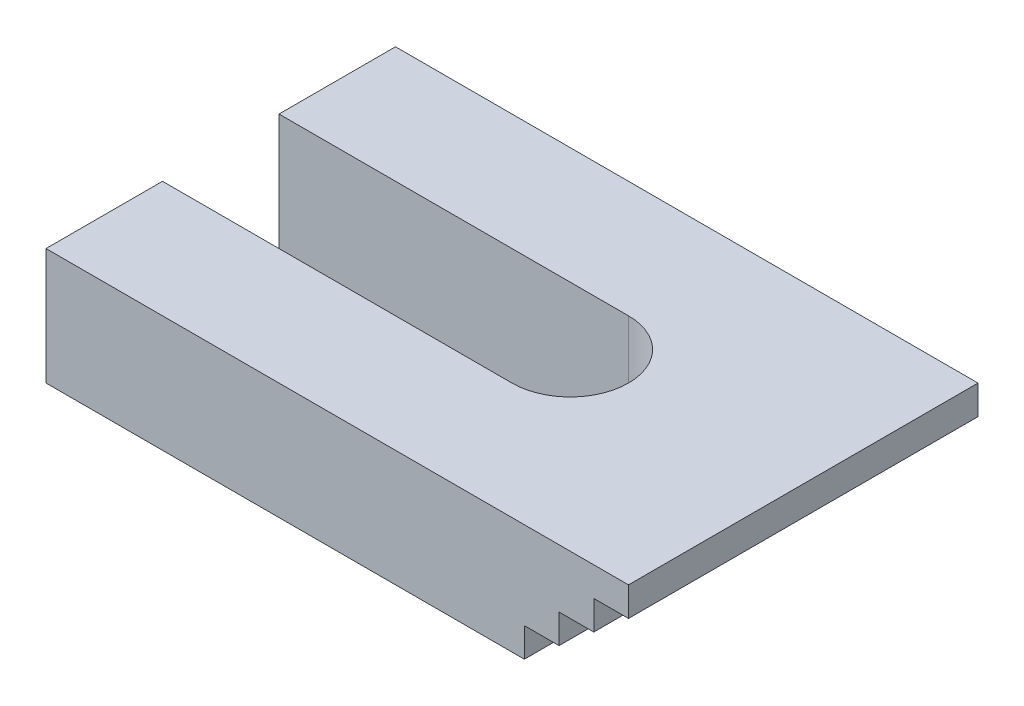
ISO-10303-21;
HEADER;
FILE_DESCRIPTION(('STEP AP214'),'2;1');
FILE_NAME('part.step','',(''),(''),'','','');
FILE_SCHEMA(('AUTOMOTIVE_DESIGN { 1 0 10303 214 1 1 1 1 }'));
ENDSEC;
DATA;
#1=APPLICATION_CONTEXT('core data for automotive mechanical design processes');
#2=APPLICATION_PROTOCOL_DEFINITION('international standard','automotive_design',2000,#1);
#3=PRODUCT_CONTEXT('',#1,'mechanical');
#4=PRODUCT('Part','Part','',(#3));
#5=PRODUCT_RELATED_PRODUCT_CATEGORY('part','',(#4));
#6=PRODUCT_DEFINITION_FORMATION('','',#4);
#7=PRODUCT_DEFINITION_CONTEXT('part definition',#1,'design');
#8=PRODUCT_DEFINITION('design','',#6,#7);
#9=PRODUCT_DEFINITION_SHAPE('','',#8);
#10=(LENGTH_UNIT() NAMED_UNIT(*) SI_UNIT(.MILLI.,.METRE.));
#11=(NAMED_UNIT(*) PLANE_ANGLE_UNIT() SI_UNIT($,.RADIAN.));
#12=(NAMED_UNIT(*) SI_UNIT($,.STERADIAN.) SOLID_ANGLE_UNIT());
#13=UNCERTAINTY_MEASURE_WITH_UNIT(LENGTH_MEASURE(1.E-05),#10,'distance_accuracy_value','');
#14=(GEOMETRIC_REPRESENTATION_CONTEXT(3) GLOBAL_UNCERTAINTY_ASSIGNED_CONTEXT((#13)) GLOBAL_UNIT_ASSIGNED_CONTEXT((#10,
#11,#12)) REPRESENTATION_CONTEXT('',''));
#15=CARTESIAN_POINT('',(0.,0.,0.));
#16=DIRECTION('',(0.,0.,1.));
#17=DIRECTION('',(1.,0.,0.));
#18=AXIS2_PLACEMENT_3D('',#15,#16,#17);
#19=CARTESIAN_POINT('',(-49.5371666557467,5.22830018411507,30.));
#20=DIRECTION('',(1.,0.,0.));
#21=DIRECTION('',(0.,0.,-1.));
#22=AXIS2_PLACEMENT_3D('',#19,#20,#21);
#23=PLANE('',#22);
#24=DIRECTION('',(0.,0.,-1.));
#25=VECTOR('',#24,1.);
#26=CARTESIAN_POINT('',(-49.5371666557467,5.22830018411507,30.));
#27=LINE('',#26,#25);
#28=CARTESIAN_POINT('',(-49.5371666557467,5.22830018411507,30.));
#29=VERTEX_POINT('',#28);
#30=CARTESIAN_POINT('',(-49.5371666557467,5.22830018411507,20.));
#31=VERTEX_POINT('',#30);
#32=EDGE_CURVE('E157',#29,#31,#27,.T.);
#33=ORIENTED_EDGE('',*,*,#32,.T.);
#34=DIRECTION('',(0.,1.,0.));
#35=VECTOR('',#34,1.);
#36=CARTESIAN_POINT('',(-49.5371666557467,-4.77169981588493,20.));
#37=LINE('',#36,#35);
#38=CARTESIAN_POINT('',(-49.5371666557467,-4.77169981588493,20.));
#39=VERTEX_POINT('',#38);
#40=EDGE_CURVE('E296',#39,#31,#37,.T.);
#41=ORIENTED_EDGE('',*,*,#40,.F.);
#42=DIRECTION('',(0.,0.,-1.));
#43=VECTOR('',#42,1.);
#44=CARTESIAN_POINT('',(-49.5371666557467,-4.77169981588494,30.));
#45=LINE('',#44,#43);
#46=CARTESIAN_POINT('',(-49.5371666557467,-4.77169981588494,30.));
#47=VERTEX_POINT('',#46);
#48=EDGE_CURVE('E199',#47,#39,#45,.T.);
#49=ORIENTED_EDGE('',*,*,#48,.F.);
#50=DIRECTION('',(0.,-1.,0.));
#51=VECTOR('',#50,1.);
#52=CARTESIAN_POINT('',(-49.5371666557467,5.22830018411507,30.));
#53=LINE('',#52,#51);
#54=EDGE_CURVE('E64',#29,#47,#53,.T.);
#55=ORIENTED_EDGE('',*,*,#54,.F.);
#56=EDGE_LOOP('',(#33,#41,#49,#55));
#57=FACE_BOUND('',#56,.T.);
#58=ADVANCED_FACE('F39',(#57),#23,.F.);
#59=CARTESIAN_POINT('',(-8.47593461871784,-4.77169981588493,30.));
#60=DIRECTION('',(0.,1.,0.));
#61=DIRECTION('',(-1.,0.,0.));
#62=AXIS2_PLACEMENT_3D('',#59,#60,#61);
#63=PLANE('',#62);
#64=ORIENTED_EDGE('',*,*,#48,.T.);
#65=DIRECTION('',(1.,0.,0.));
#66=VECTOR('',#65,1.);
#67=CARTESIAN_POINT('',(-19.5371666557467,-4.77169981588493,20.));
#68=LINE('',#67,#66);
#69=CARTESIAN_POINT('',(-19.5371666557467,-4.77169981588493,20.));
#70=VERTEX_POINT('',#69);
#71=EDGE_CURVE('E292',#39,#70,#68,.T.);
#72=ORIENTED_EDGE('',*,*,#71,.T.);
#73=CARTESIAN_POINT('',(-19.5371666557467,-4.77169981588493,15.));
#74=DIRECTION('',(0.,1.,0.));
#75=DIRECTION('',(0.,0.,-1.));
#76=AXIS2_PLACEMENT_3D('',#73,#74,#75);
#77=CIRCLE('',#76,5.);
#78=CARTESIAN_POINT('',(-19.5371666557467,-4.77169981588493,10.));
#79=VERTEX_POINT('',#78);
#80=EDGE_CURVE('E286',#70,#79,#77,.T.);
#81=ORIENTED_EDGE('',*,*,#80,.T.);
#82=DIRECTION('',(-1.,0.,0.));
#83=VECTOR('',#82,1.);
#84=CARTESIAN_POINT('',(-19.5371666557467,-4.77169981588493,10.));
#85=LINE('',#84,#83);
#86=CARTESIAN_POINT('',(-49.5371666557467,-4.77169981588493,10.));
#87=VERTEX_POINT('',#86);
#88=EDGE_CURVE('E281',#79,#87,#85,.T.);
#89=ORIENTED_EDGE('',*,*,#88,.T.);
#90=CARTESIAN_POINT('',(-49.5371666557467,-4.77169981588494,0.));
#91=VERTEX_POINT('',#90);
#92=EDGE_CURVE('E104',#87,#91,#45,.T.);
#93=ORIENTED_EDGE('',*,*,#92,.T.);
#94=DIRECTION('',(1.,0.,0.));
#95=VECTOR('',#94,1.);
#96=CARTESIAN_POINT('',(-8.47593461871784,-4.77169981588493,0.));
#97=LINE('',#96,#95);
#98=CARTESIAN_POINT('',(-8.47593461871784,-4.77169981588493,0.));
#99=VERTEX_POINT('',#98);
#100=EDGE_CURVE('E168',#91,#99,#97,.T.);
#101=ORIENTED_EDGE('',*,*,#100,.T.);
#102=DIRECTION('',(0.,0.,-1.));
#103=VECTOR('',#102,1.);
#104=CARTESIAN_POINT('',(-8.47593461871784,-4.77169981588493,30.));
#105=LINE('',#104,#103);
#106=CARTESIAN_POINT('',(-8.47593461871784,-4.77169981588493,30.));
#107=VERTEX_POINT('',#106);
#108=EDGE_CURVE('E48',#107,#99,#105,.T.);
#109=ORIENTED_EDGE('',*,*,#108,.F.);
#110=DIRECTION('',(1.,0.,0.));
#111=VECTOR('',#110,1.);
#112=CARTESIAN_POINT('',(-8.47593461871784,-4.77169981588493,30.));
#113=LINE('',#112,#111);
#114=EDGE_CURVE('E198',#47,#107,#113,.T.);
#115=ORIENTED_EDGE('',*,*,#114,.F.);
#116=EDGE_LOOP('',(#64,#72,#81,#89,#93,#101,#109,#115));
#117=FACE_BOUND('',#116,.T.);
#118=ADVANCED_FACE('F41',(#117),#63,.F.);
#119=CARTESIAN_POINT('',(-8.47593461871784,-4.77169981588493,30.));
#120=DIRECTION('',(-1.,0.,0.));
#121=DIRECTION('',(0.,0.,1.));
#122=AXIS2_PLACEMENT_3D('',#119,#120,#121);
#123=PLANE('',#122);
#124=DIRECTION('',(0.,1.,0.));
#125=VECTOR('',#124,1.);
#126=CARTESIAN_POINT('',(-8.47593461871784,-4.77169981588493,0.));
#127=LINE('',#126,#125);
#128=CARTESIAN_POINT('',(-8.47593461871784,-2.27169981588494,0.));
#129=VERTEX_POINT('',#128);
#130=EDGE_CURVE('E171',#99,#129,#127,.T.);
#131=ORIENTED_EDGE('',*,*,#130,.T.);
#132=DIRECTION('',(0.,0.,-1.));
#133=VECTOR('',#132,1.);
#134=CARTESIAN_POINT('',(-8.47593461871784,-2.27169981588494,30.));
#135=LINE('',#134,#133);
#136=CARTESIAN_POINT('',(-8.47593461871784,-2.27169981588494,30.));
#137=VERTEX_POINT('',#136);
#138=EDGE_CURVE('E224',#137,#129,#135,.T.);
#139=ORIENTED_EDGE('',*,*,#138,.F.);
#140=DIRECTION('',(0.,1.,0.));
#141=VECTOR('',#140,1.);
#142=CARTESIAN_POINT('',(-8.47593461871784,-4.77169981588493,30.));
#143=LINE('',#142,#141);
#144=EDGE_CURVE('E113',#107,#137,#143,.T.);
#145=ORIENTED_EDGE('',*,*,#144,.F.);
#146=ORIENTED_EDGE('',*,*,#108,.T.);
#147=EDGE_LOOP('',(#131,#139,#145,#146));
#148=FACE_BOUND('',#147,.T.);
#149=ADVANCED_FACE('F229',(#148),#123,.F.);
#150=CARTESIAN_POINT('',(-8.47593461871784,-2.27169981588494,30.));
#151=DIRECTION('',(0.,1.,0.));
#152=DIRECTION('',(0.,0.,1.));
#153=AXIS2_PLACEMENT_3D('',#150,#151,#152);
#154=PLANE('',#153);
#155=DIRECTION('',(1.,0.,0.));
#156=VECTOR('',#155,1.);
#157=CARTESIAN_POINT('',(-8.47593461871784,-2.27169981588494,0.));
#158=LINE('',#157,#156);
#159=CARTESIAN_POINT('',(-5.49655063723228,-2.27169981588494,0.));
#160=VERTEX_POINT('',#159);
#161=EDGE_CURVE('E175',#129,#160,#158,.T.);
#162=ORIENTED_EDGE('',*,*,#161,.T.);
#163=DIRECTION('',(0.,0.,-1.));
#164=VECTOR('',#163,1.);
#165=CARTESIAN_POINT('',(-5.49655063723228,-2.27169981588494,30.));
#166=LINE('',#165,#164);
#167=CARTESIAN_POINT('',(-5.49655063723228,-2.27169981588494,30.));
#168=VERTEX_POINT('',#167);
#169=EDGE_CURVE('E220',#168,#160,#166,.T.);
#170=ORIENTED_EDGE('',*,*,#169,.F.);
#171=DIRECTION('',(1.,0.,0.));
#172=VECTOR('',#171,1.);
#173=CARTESIAN_POINT('',(-8.47593461871784,-2.27169981588494,30.));
#174=LINE('',#173,#172);
#175=EDGE_CURVE('E250',#137,#168,#174,.T.);
#176=ORIENTED_EDGE('',*,*,#175,.F.);
#177=ORIENTED_EDGE('',*,*,#138,.T.);
#178=EDGE_LOOP('',(#162,#170,#176,#177));
#179=FACE_BOUND('',#178,.T.);
#180=ADVANCED_FACE('F240',(#179),#154,.F.);
#181=CARTESIAN_POINT('',(-5.49655063723228,-2.27169981588494,30.));
#182=DIRECTION('',(-1.,0.,0.));
#183=DIRECTION('',(0.,0.,1.));
#184=AXIS2_PLACEMENT_3D('',#181,#182,#183);
#185=PLANE('',#184);
#186=DIRECTION('',(0.,1.,0.));
#187=VECTOR('',#186,1.);
#188=CARTESIAN_POINT('',(-5.49655063723228,-2.27169981588494,0.));
#189=LINE('',#188,#187);
#190=CARTESIAN_POINT('',(-5.49655063723228,0.228300184115063,0.));
#191=VERTEX_POINT('',#190);
#192=EDGE_CURVE('E178',#160,#191,#189,.T.);
#193=ORIENTED_EDGE('',*,*,#192,.T.);
#194=DIRECTION('',(0.,0.,-1.));
#195=VECTOR('',#194,1.);
#196=CARTESIAN_POINT('',(-5.49655063723228,0.228300184115063,30.));
#197=LINE('',#196,#195);
#198=CARTESIAN_POINT('',(-5.49655063723228,0.228300184115063,30.));
#199=VERTEX_POINT('',#198);
#200=EDGE_CURVE('E216',#199,#191,#197,.T.);
#201=ORIENTED_EDGE('',*,*,#200,.F.);
#202=DIRECTION('',(0.,1.,0.));
#203=VECTOR('',#202,1.);
#204=CARTESIAN_POINT('',(-5.49655063723228,-2.27169981588494,30.));
#205=LINE('',#204,#203);
#206=EDGE_CURVE('E246',#168,#199,#205,.T.);
#207=ORIENTED_EDGE('',*,*,#206,.F.);
#208=ORIENTED_EDGE('',*,*,#169,.T.);
#209=EDGE_LOOP('',(#193,#201,#207,#208));
#210=FACE_BOUND('',#209,.T.);
#211=ADVANCED_FACE('F244',(#210),#185,.F.);
#212=CARTESIAN_POINT('',(-5.49655063723228,0.228300184115063,30.));
#213=DIRECTION('',(0.,1.,0.));
#214=DIRECTION('',(0.,0.,1.));
#215=AXIS2_PLACEMENT_3D('',#212,#213,#214);
#216=PLANE('',#215);
#217=DIRECTION('',(1.,0.,0.));
#218=VECTOR('',#217,1.);
#219=CARTESIAN_POINT('',(-5.49655063723228,0.228300184115063,0.));
#220=LINE('',#219,#218);
#221=CARTESIAN_POINT('',(-2.51716665574672,0.228300184115063,0.));
#222=VERTEX_POINT('',#221);
#223=EDGE_CURVE('E181',#191,#222,#220,.T.);
#224=ORIENTED_EDGE('',*,*,#223,.T.);
#225=DIRECTION('',(0.,0.,-1.));
#226=VECTOR('',#225,1.);
#227=CARTESIAN_POINT('',(-2.51716665574672,0.228300184115063,30.));
#228=LINE('',#227,#226);
#229=CARTESIAN_POINT('',(-2.51716665574672,0.228300184115063,30.));
#230=VERTEX_POINT('',#229);
#231=EDGE_CURVE('E212',#230,#222,#228,.T.);
#232=ORIENTED_EDGE('',*,*,#231,.F.);
#233=DIRECTION('',(1.,0.,0.));
#234=VECTOR('',#233,1.);
#235=CARTESIAN_POINT('',(-5.49655063723228,0.228300184115063,30.));
#236=LINE('',#235,#234);
#237=EDGE_CURVE('E249',#199,#230,#236,.T.);
#238=ORIENTED_EDGE('',*,*,#237,.F.);
#239=ORIENTED_EDGE('',*,*,#200,.T.);
#240=EDGE_LOOP('',(#224,#232,#238,#239));
#241=FACE_BOUND('',#240,.T.);
#242=ADVANCED_FACE('F361',(#241),#216,.F.);
#243=CARTESIAN_POINT('',(-2.51716665574672,0.228300184115063,30.));
#244=DIRECTION('',(-1.,0.,0.));
#245=DIRECTION('',(0.,0.,1.));
#246=AXIS2_PLACEMENT_3D('',#243,#244,#245);
#247=PLANE('',#246);
#248=DIRECTION('',(0.,1.,0.));
#249=VECTOR('',#248,1.);
#250=CARTESIAN_POINT('',(-2.51716665574672,0.228300184115063,0.));
#251=LINE('',#250,#249);
#252=CARTESIAN_POINT('',(-2.51716665574672,2.72830018411507,0.));
#253=VERTEX_POINT('',#252);
#254=EDGE_CURVE('E184',#222,#253,#251,.T.);
#255=ORIENTED_EDGE('',*,*,#254,.T.);
#256=DIRECTION('',(0.,0.,-1.));
#257=VECTOR('',#256,1.);
#258=CARTESIAN_POINT('',(-2.51716665574672,2.72830018411507,30.));
#259=LINE('',#258,#257);
#260=CARTESIAN_POINT('',(-2.51716665574672,2.72830018411507,30.));
#261=VERTEX_POINT('',#260);
#262=EDGE_CURVE('E208',#261,#253,#259,.T.);
#263=ORIENTED_EDGE('',*,*,#262,.F.);
#264=DIRECTION('',(0.,1.,0.));
#265=VECTOR('',#264,1.);
#266=CARTESIAN_POINT('',(-2.51716665574672,0.228300184115063,30.));
#267=LINE('',#266,#265);
#268=EDGE_CURVE('E254',#230,#261,#267,.T.);
#269=ORIENTED_EDGE('',*,*,#268,.F.);
#270=ORIENTED_EDGE('',*,*,#231,.T.);
#271=EDGE_LOOP('',(#255,#263,#269,#270));
#272=FACE_BOUND('',#271,.T.);
#273=ADVANCED_FACE('F265',(#272),#247,.F.);
#274=CARTESIAN_POINT('',(-2.51716665574672,2.72830018411507,30.));
#275=DIRECTION('',(0.,1.,0.));
#276=DIRECTION('',(0.,0.,1.));
#277=AXIS2_PLACEMENT_3D('',#274,#275,#276);
#278=PLANE('',#277);
#279=DIRECTION('',(1.,0.,0.));
#280=VECTOR('',#279,1.);
#281=CARTESIAN_POINT('',(-2.51716665574672,2.72830018411507,0.));
#282=LINE('',#281,#280);
#283=CARTESIAN_POINT('',(0.462833344253281,2.72830018411507,0.));
#284=VERTEX_POINT('',#283);
#285=EDGE_CURVE('E187',#253,#284,#282,.T.);
#286=ORIENTED_EDGE('',*,*,#285,.T.);
#287=DIRECTION('',(0.,0.,-1.));
#288=VECTOR('',#287,1.);
#289=CARTESIAN_POINT('',(0.462833344253281,2.72830018411507,30.));
#290=LINE('',#289,#288);
#291=CARTESIAN_POINT('',(0.462833344253281,2.72830018411507,30.));
#292=VERTEX_POINT('',#291);
#293=EDGE_CURVE('E156',#292,#284,#290,.T.);
#294=ORIENTED_EDGE('',*,*,#293,.F.);
#295=DIRECTION('',(1.,0.,0.));
#296=VECTOR('',#295,1.);
#297=CARTESIAN_POINT('',(-2.51716665574672,2.72830018411507,30.));
#298=LINE('',#297,#296);
#299=EDGE_CURVE('E141',#261,#292,#298,.T.);
#300=ORIENTED_EDGE('',*,*,#299,.F.);
#301=ORIENTED_EDGE('',*,*,#262,.T.);
#302=EDGE_LOOP('',(#286,#294,#300,#301));
#303=FACE_BOUND('',#302,.T.);
#304=ADVANCED_FACE('F269',(#303),#278,.F.);
#305=CARTESIAN_POINT('',(0.462833344253281,2.72830018411507,30.));
#306=DIRECTION('',(-1.,0.,0.));
#307=DIRECTION('',(0.,0.,1.));
#308=AXIS2_PLACEMENT_3D('',#305,#306,#307);
#309=PLANE('',#308);
#310=DIRECTION('',(0.,1.,0.));
#311=VECTOR('',#310,1.);
#312=CARTESIAN_POINT('',(0.462833344253281,2.72830018411507,0.));
#313=LINE('',#312,#311);
#314=CARTESIAN_POINT('',(0.462833344253281,5.22830018411507,0.));
#315=VERTEX_POINT('',#314);
#316=EDGE_CURVE('E151',#284,#315,#313,.T.);
#317=ORIENTED_EDGE('',*,*,#316,.T.);
#318=DIRECTION('',(0.,0.,-1.));
#319=VECTOR('',#318,1.);
#320=CARTESIAN_POINT('',(0.462833344253281,5.22830018411507,30.));
#321=LINE('',#320,#319);
#322=CARTESIAN_POINT('',(0.462833344253281,5.22830018411507,30.));
#323=VERTEX_POINT('',#322);
#324=EDGE_CURVE('E148',#323,#315,#321,.T.);
#325=ORIENTED_EDGE('',*,*,#324,.F.);
#326=DIRECTION('',(0.,1.,0.));
#327=VECTOR('',#326,1.);
#328=CARTESIAN_POINT('',(0.462833344253281,2.72830018411507,30.));
#329=LINE('',#328,#327);
#330=EDGE_CURVE('E134',#292,#323,#329,.T.);
#331=ORIENTED_EDGE('',*,*,#330,.F.);
#332=ORIENTED_EDGE('',*,*,#293,.T.);
#333=EDGE_LOOP('',(#317,#325,#331,#332));
#334=FACE_BOUND('',#333,.T.);
#335=ADVANCED_FACE('F149',(#334),#309,.F.);
#336=CARTESIAN_POINT('',(0.462833344253281,5.22830018411507,30.));
#337=DIRECTION('',(0.,-1.,0.));
#338=DIRECTION('',(1.,0.,0.));
#339=AXIS2_PLACEMENT_3D('',#336,#337,#338);
#340=PLANE('',#339);
#341=CARTESIAN_POINT('',(-19.5371666557467,5.22830018411507,15.));
#342=DIRECTION('',(0.,-1.,0.));
#343=DIRECTION('',(1.,0.,0.));
#344=AXIS2_PLACEMENT_3D('',#341,#342,#343);
#345=CIRCLE('',#344,5.);
#346=CARTESIAN_POINT('',(-19.5371666557467,5.22830018411507,10.));
#347=VERTEX_POINT('',#346);
#348=CARTESIAN_POINT('',(-19.5371666557467,5.22830018411507,20.));
#349=VERTEX_POINT('',#348);
#350=EDGE_CURVE('E11',#347,#349,#345,.T.);
#351=ORIENTED_EDGE('',*,*,#350,.T.);
#352=DIRECTION('',(-1.,0.,0.));
#353=VECTOR('',#352,1.);
#354=CARTESIAN_POINT('',(0.462833344253281,5.22830018411507,20.));
#355=LINE('',#354,#353);
#356=EDGE_CURVE('E172',#349,#31,#355,.T.);
#357=ORIENTED_EDGE('',*,*,#356,.T.);
#358=ORIENTED_EDGE('',*,*,#32,.F.);
#359=DIRECTION('',(-1.,0.,0.));
#360=VECTOR('',#359,1.);
#361=CARTESIAN_POINT('',(0.462833344253281,5.22830018411507,30.));
#362=LINE('',#361,#360);
#363=EDGE_CURVE('E138',#323,#29,#362,.T.);
#364=ORIENTED_EDGE('',*,*,#363,.F.);
#365=ORIENTED_EDGE('',*,*,#324,.T.);
#366=DIRECTION('',(-1.,0.,0.));
#367=VECTOR('',#366,1.);
#368=CARTESIAN_POINT('',(0.462833344253281,5.22830018411507,0.));
#369=LINE('',#368,#367);
#370=CARTESIAN_POINT('',(-49.5371666557467,5.22830018411507,0.));
#371=VERTEX_POINT('',#370);
#372=EDGE_CURVE('E192',#315,#371,#369,.T.);
#373=ORIENTED_EDGE('',*,*,#372,.T.);
#374=CARTESIAN_POINT('',(-49.5371666557467,5.22830018411507,10.));
#375=VERTEX_POINT('',#374);
#376=EDGE_CURVE('E203',#375,#371,#27,.T.);
#377=ORIENTED_EDGE('',*,*,#376,.F.);
#378=DIRECTION('',(1.,0.,0.));
#379=VECTOR('',#378,1.);
#380=CARTESIAN_POINT('',(0.462833344253281,5.22830018411507,10.));
#381=LINE('',#380,#379);
#382=EDGE_CURVE('E55',#375,#347,#381,.T.);
#383=ORIENTED_EDGE('',*,*,#382,.T.);
#384=EDGE_LOOP('',(#351,#357,#358,#364,#365,#373,#377,#383));
#385=FACE_BOUND('',#384,.T.);
#386=ADVANCED_FACE('F159',(#385),#340,.F.);
#387=ORIENTED_EDGE('',*,*,#92,.F.);
#388=DIRECTION('',(0.,1.,0.));
#389=VECTOR('',#388,1.);
#390=CARTESIAN_POINT('',(-49.5371666557467,-4.77169981588493,10.));
#391=LINE('',#390,#389);
#392=EDGE_CURVE('E276',#87,#375,#391,.T.);
#393=ORIENTED_EDGE('',*,*,#392,.T.);
#394=ORIENTED_EDGE('',*,*,#376,.T.);
#395=DIRECTION('',(0.,-1.,0.));
#396=VECTOR('',#395,1.);
#397=CARTESIAN_POINT('',(-49.5371666557467,5.22830018411507,0.));
#398=LINE('',#397,#396);
#399=EDGE_CURVE('E195',#371,#91,#398,.T.);
#400=ORIENTED_EDGE('',*,*,#399,.T.);
#401=EDGE_LOOP('',(#387,#393,#394,#400));
#402=FACE_BOUND('',#401,.T.);
#403=ADVANCED_FACE('F275',(#402),#23,.F.);
#404=CARTESIAN_POINT('',(0.,0.,30.));
#405=DIRECTION('',(0.,0.,1.));
#406=DIRECTION('',(1.,0.,0.));
#407=AXIS2_PLACEMENT_3D('',#404,#405,#406);
#408=PLANE('',#407);
#409=ORIENTED_EDGE('',*,*,#114,.T.);
#410=ORIENTED_EDGE('',*,*,#144,.T.);
#411=ORIENTED_EDGE('',*,*,#175,.T.);
#412=ORIENTED_EDGE('',*,*,#206,.T.);
#413=ORIENTED_EDGE('',*,*,#237,.T.);
#414=ORIENTED_EDGE('',*,*,#268,.T.);
#415=ORIENTED_EDGE('',*,*,#299,.T.);
#416=ORIENTED_EDGE('',*,*,#330,.T.);
#417=ORIENTED_EDGE('',*,*,#363,.T.);
#418=ORIENTED_EDGE('',*,*,#54,.T.);
#419=EDGE_LOOP('',(#409,#410,#411,#412,#413,#414,#415,#416,#417,#418));
#420=FACE_BOUND('',#419,.T.);
#421=ADVANCED_FACE('F136',(#420),#408,.T.);
#422=CARTESIAN_POINT('',(0.,0.,0.));
#423=DIRECTION('',(0.,0.,1.));
#424=DIRECTION('',(1.,0.,0.));
#425=AXIS2_PLACEMENT_3D('',#422,#423,#424);
#426=PLANE('',#425);
#427=ORIENTED_EDGE('',*,*,#100,.F.);
#428=ORIENTED_EDGE('',*,*,#399,.F.);
#429=ORIENTED_EDGE('',*,*,#372,.F.);
#430=ORIENTED_EDGE('',*,*,#316,.F.);
#431=ORIENTED_EDGE('',*,*,#285,.F.);
#432=ORIENTED_EDGE('',*,*,#254,.F.);
#433=ORIENTED_EDGE('',*,*,#223,.F.);
#434=ORIENTED_EDGE('',*,*,#192,.F.);
#435=ORIENTED_EDGE('',*,*,#161,.F.);
#436=ORIENTED_EDGE('',*,*,#130,.F.);
#437=EDGE_LOOP('',(#427,#428,#429,#430,#431,#432,#433,#434,#435,#436));
#438=FACE_BOUND('',#437,.T.);
#439=ADVANCED_FACE('F234',(#438),#426,.F.);
#440=CARTESIAN_POINT('',(-19.5371666557467,-4.77169981588493,15.));
#441=DIRECTION('',(0.,1.,0.));
#442=DIRECTION('',(0.,0.,1.));
#443=AXIS2_PLACEMENT_3D('',#440,#441,#442);
#444=CYLINDRICAL_SURFACE('',#443,5.);
#445=ORIENTED_EDGE('',*,*,#350,.F.);
#446=DIRECTION('',(0.,1.,0.));
#447=VECTOR('',#446,1.);
#448=CARTESIAN_POINT('',(-19.5371666557467,-4.77169981588493,10.));
#449=LINE('',#448,#447);
#450=EDGE_CURVE('E288',#79,#347,#449,.T.);
#451=ORIENTED_EDGE('',*,*,#450,.F.);
#452=ORIENTED_EDGE('',*,*,#80,.F.);
#453=DIRECTION('',(0.,1.,0.));
#454=VECTOR('',#453,1.);
#455=CARTESIAN_POINT('',(-19.5371666557467,-4.77169981588493,20.));
#456=LINE('',#455,#454);
#457=EDGE_CURVE('E280',#70,#349,#456,.T.);
#458=ORIENTED_EDGE('',*,*,#457,.T.);
#459=EDGE_LOOP('',(#445,#451,#452,#458));
#460=FACE_BOUND('',#459,.T.);
#461=ADVANCED_FACE('F323',(#460),#444,.F.);
#462=CARTESIAN_POINT('',(-19.5371666557467,-4.77169981588493,20.));
#463=DIRECTION('',(0.,0.,1.));
#464=DIRECTION('',(1.,0.,0.));
#465=AXIS2_PLACEMENT_3D('',#462,#463,#464);
#466=PLANE('',#465);
#467=ORIENTED_EDGE('',*,*,#356,.F.);
#468=ORIENTED_EDGE('',*,*,#457,.F.);
#469=ORIENTED_EDGE('',*,*,#71,.F.);
#470=ORIENTED_EDGE('',*,*,#40,.T.);
#471=EDGE_LOOP('',(#467,#468,#469,#470));
#472=FACE_BOUND('',#471,.T.);
#473=ADVANCED_FACE('F317',(#472),#466,.F.);
#474=CARTESIAN_POINT('',(-19.5371666557467,-4.77169981588493,10.));
#475=DIRECTION('',(0.,0.,-1.));
#476=DIRECTION('',(-1.,0.,0.));
#477=AXIS2_PLACEMENT_3D('',#474,#475,#476);
#478=PLANE('',#477);
#479=ORIENTED_EDGE('',*,*,#382,.F.);
#480=ORIENTED_EDGE('',*,*,#392,.F.);
#481=ORIENTED_EDGE('',*,*,#88,.F.);
#482=ORIENTED_EDGE('',*,*,#450,.T.);
#483=EDGE_LOOP('',(#479,#480,#481,#482));
#484=FACE_BOUND('',#483,.T.);
#485=ADVANCED_FACE('F326',(#484),#478,.F.);
#486=CLOSED_SHELL('',(#58,#118,#149,#180,#211,#242,#273,#304,#335,#386,#403,#421,#439,#461,#473,#485));
#487=MANIFOLD_SOLID_BREP('B2',#486);
#488=ADVANCED_BREP_SHAPE_REPRESENTATION('',(#18,#487),#14);
#489=SHAPE_DEFINITION_REPRESENTATION(#9,#488);
ENDSEC;
END-ISO-10303-21;
